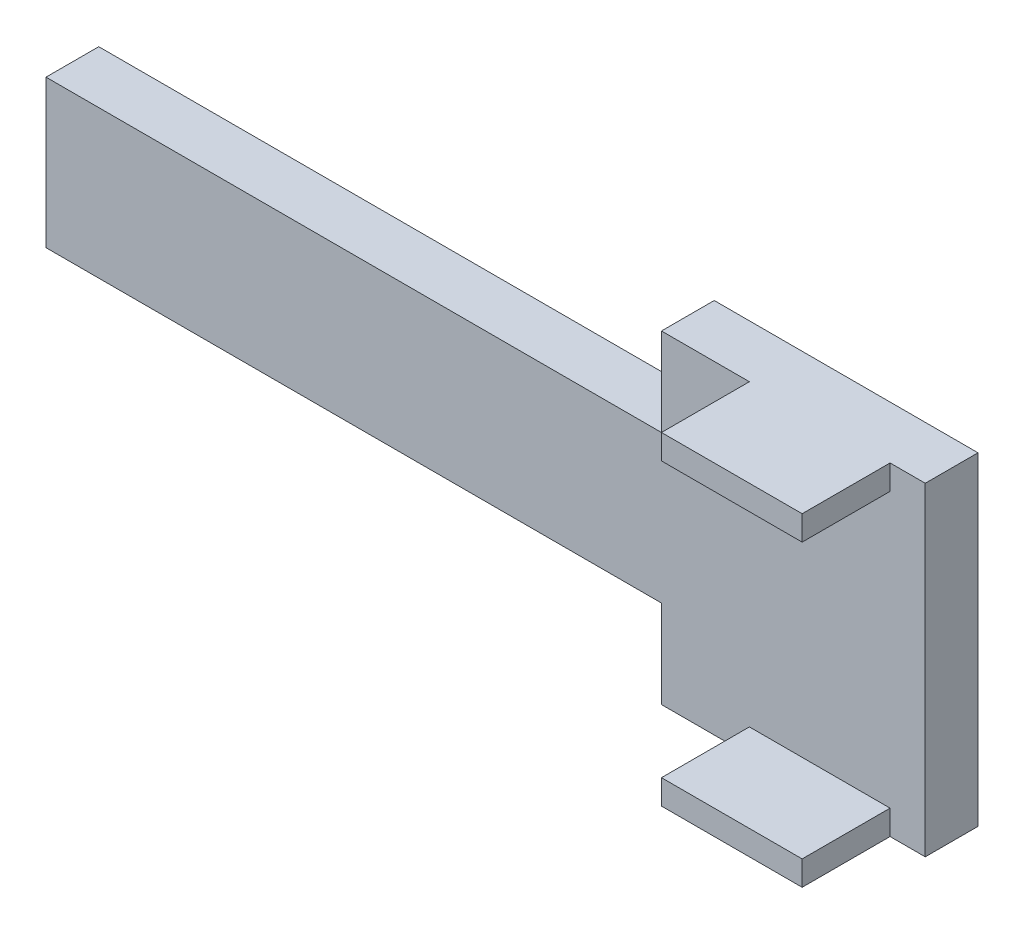
ISO-10303-21;
HEADER;
FILE_DESCRIPTION(('STEP AP214'),'2;1');
FILE_NAME('part.step','',(''),(''),'','','');
FILE_SCHEMA(('AUTOMOTIVE_DESIGN { 1 0 10303 214 1 1 1 1 }'));
ENDSEC;
DATA;
#1=APPLICATION_CONTEXT('core data for automotive mechanical design processes');
#2=APPLICATION_PROTOCOL_DEFINITION('international standard','automotive_design',2000,#1);
#3=PRODUCT_CONTEXT('',#1,'mechanical');
#4=PRODUCT('Part','Part','',(#3));
#5=PRODUCT_RELATED_PRODUCT_CATEGORY('part','',(#4));
#6=PRODUCT_DEFINITION_FORMATION('','',#4);
#7=PRODUCT_DEFINITION_CONTEXT('part definition',#1,'design');
#8=PRODUCT_DEFINITION('design','',#6,#7);
#9=PRODUCT_DEFINITION_SHAPE('','',#8);
#10=(LENGTH_UNIT() NAMED_UNIT(*) SI_UNIT(.MILLI.,.METRE.));
#11=(NAMED_UNIT(*) PLANE_ANGLE_UNIT() SI_UNIT($,.RADIAN.));
#12=(NAMED_UNIT(*) SI_UNIT($,.STERADIAN.) SOLID_ANGLE_UNIT());
#13=UNCERTAINTY_MEASURE_WITH_UNIT(LENGTH_MEASURE(1.E-05),#10,'distance_accuracy_value','');
#14=(GEOMETRIC_REPRESENTATION_CONTEXT(3) GLOBAL_UNCERTAINTY_ASSIGNED_CONTEXT((#13)) GLOBAL_UNIT_ASSIGNED_CONTEXT((#10,
#11,#12)) REPRESENTATION_CONTEXT('',''));
#15=CARTESIAN_POINT('',(0.,0.,0.));
#16=DIRECTION('',(0.,0.,1.));
#17=DIRECTION('',(1.,0.,0.));
#18=AXIS2_PLACEMENT_3D('',#15,#16,#17);
#19=CARTESIAN_POINT('',(-0.139449066959385,0.,3.84185455543359));
#20=DIRECTION('',(0.,0.,-1.));
#21=DIRECTION('',(-1.,0.,0.));
#22=AXIS2_PLACEMENT_3D('',#19,#20,#21);
#23=PLANE('',#22);
#24=DIRECTION('',(0.,-1.,0.));
#25=VECTOR('',#24,1.);
#26=CARTESIAN_POINT('',(12.8145509330406,11.91768,3.84185455543359));
#27=LINE('',#26,#25);
#28=CARTESIAN_POINT('',(12.8145509330406,11.91768,3.84185455543359));
#29=VERTEX_POINT('',#28);
#30=CARTESIAN_POINT('',(12.8145509330406,5.44068,3.84185455543359));
#31=VERTEX_POINT('',#30);
#32=EDGE_CURVE('E157',#29,#31,#27,.T.);
#33=ORIENTED_EDGE('',*,*,#32,.T.);
#34=DIRECTION('',(-1.,0.,0.));
#35=VECTOR('',#34,1.);
#36=CARTESIAN_POINT('',(-32.5244490669594,5.44068,3.84185455543359));
#37=LINE('',#36,#35);
#38=CARTESIAN_POINT('',(-32.5244490669594,5.44068,3.84185455543359));
#39=VERTEX_POINT('',#38);
#40=EDGE_CURVE('E302',#31,#39,#37,.T.);
#41=ORIENTED_EDGE('',*,*,#40,.T.);
#42=DIRECTION('',(0.,-1.,0.));
#43=VECTOR('',#42,1.);
#44=CARTESIAN_POINT('',(-32.5244490669594,-11.91768,3.84185455543359));
#45=LINE('',#44,#43);
#46=CARTESIAN_POINT('',(-32.5244490669594,-5.44068,3.84185455543359));
#47=VERTEX_POINT('',#46);
#48=EDGE_CURVE('E164',#39,#47,#45,.T.);
#49=ORIENTED_EDGE('',*,*,#48,.T.);
#50=DIRECTION('',(-1.,0.,0.));
#51=VECTOR('',#50,1.);
#52=CARTESIAN_POINT('',(-32.5244490669594,-5.44068,3.84185455543359));
#53=LINE('',#52,#51);
#54=CARTESIAN_POINT('',(12.8145509330406,-5.44068,3.84185455543359));
#55=VERTEX_POINT('',#54);
#56=EDGE_CURVE('E220',#55,#47,#53,.T.);
#57=ORIENTED_EDGE('',*,*,#56,.F.);
#58=DIRECTION('',(0.,1.,0.));
#59=VECTOR('',#58,1.);
#60=CARTESIAN_POINT('',(12.8145509330406,-11.91768,3.84185455543359));
#61=LINE('',#60,#59);
#62=CARTESIAN_POINT('',(12.8145509330406,-11.91768,3.84185455543359));
#63=VERTEX_POINT('',#62);
#64=EDGE_CURVE('E217',#63,#55,#61,.T.);
#65=ORIENTED_EDGE('',*,*,#64,.F.);
#66=DIRECTION('',(1.,0.,0.));
#67=VECTOR('',#66,1.);
#68=CARTESIAN_POINT('',(-32.5244490669594,-11.91768,3.84185455543359));
#69=LINE('',#68,#67);
#70=CARTESIAN_POINT('',(19.2915509330406,-11.91768,3.84185455543359));
#71=VERTEX_POINT('',#70);
#72=EDGE_CURVE('E178',#63,#71,#69,.T.);
#73=ORIENTED_EDGE('',*,*,#72,.T.);
#74=DIRECTION('',(0.,-1.,0.));
#75=VECTOR('',#74,1.);
#76=CARTESIAN_POINT('',(19.2915509330406,-11.91768,3.84185455543359));
#77=LINE('',#76,#75);
#78=CARTESIAN_POINT('',(19.2915509330406,-10.10412,3.84185455543359));
#79=VERTEX_POINT('',#78);
#80=EDGE_CURVE('E265',#79,#71,#77,.T.);
#81=ORIENTED_EDGE('',*,*,#80,.F.);
#82=DIRECTION('',(-1.,0.,0.));
#83=VECTOR('',#82,1.);
#84=CARTESIAN_POINT('',(32.2455509330406,-10.10412,3.84185455543359));
#85=LINE('',#84,#83);
#86=CARTESIAN_POINT('',(29.6547509330406,-10.10412,3.84185455543359));
#87=VERTEX_POINT('',#86);
#88=EDGE_CURVE('E261',#87,#79,#85,.T.);
#89=ORIENTED_EDGE('',*,*,#88,.F.);
#90=DIRECTION('',(0.,1.,0.));
#91=VECTOR('',#90,1.);
#92=CARTESIAN_POINT('',(29.6547509330406,-11.91768,3.84185455543359));
#93=LINE('',#92,#91);
#94=CARTESIAN_POINT('',(29.6547509330406,-11.91768,3.84185455543359));
#95=VERTEX_POINT('',#94);
#96=EDGE_CURVE('E254',#95,#87,#93,.T.);
#97=ORIENTED_EDGE('',*,*,#96,.F.);
#98=DIRECTION('',(-1.,0.,0.));
#99=VECTOR('',#98,1.);
#100=CARTESIAN_POINT('',(32.2455509330406,-11.91768,3.84185455543359));
#101=LINE('',#100,#99);
#102=CARTESIAN_POINT('',(32.2455509330406,-11.91768,3.84185455543359));
#103=VERTEX_POINT('',#102);
#104=EDGE_CURVE('E238',#103,#95,#101,.T.);
#105=ORIENTED_EDGE('',*,*,#104,.F.);
#106=DIRECTION('',(0.,1.,0.));
#107=VECTOR('',#106,1.);
#108=CARTESIAN_POINT('',(32.2455509330406,-11.91768,3.84185455543359));
#109=LINE('',#108,#107);
#110=CARTESIAN_POINT('',(32.2455509330406,11.91768,3.84185455543359));
#111=VERTEX_POINT('',#110);
#112=EDGE_CURVE('E171',#103,#111,#109,.T.);
#113=ORIENTED_EDGE('',*,*,#112,.T.);
#114=DIRECTION('',(-1.,0.,0.));
#115=VECTOR('',#114,1.);
#116=CARTESIAN_POINT('',(32.2455509330406,11.91768,3.84185455543359));
#117=LINE('',#116,#115);
#118=CARTESIAN_POINT('',(29.6547509330406,11.91768,3.84185455543359));
#119=VERTEX_POINT('',#118);
#120=EDGE_CURVE('E234',#111,#119,#117,.T.);
#121=ORIENTED_EDGE('',*,*,#120,.T.);
#122=CARTESIAN_POINT('',(29.6547509330406,10.10412,3.84185455543359));
#123=VERTEX_POINT('',#122);
#124=EDGE_CURVE('E245',#123,#119,#93,.T.);
#125=ORIENTED_EDGE('',*,*,#124,.F.);
#126=DIRECTION('',(1.,0.,0.));
#127=VECTOR('',#126,1.);
#128=CARTESIAN_POINT('',(32.2455509330406,10.10412,3.84185455543359));
#129=LINE('',#128,#127);
#130=CARTESIAN_POINT('',(19.2915509330406,10.10412,3.84185455543359));
#131=VERTEX_POINT('',#130);
#132=EDGE_CURVE('E281',#131,#123,#129,.T.);
#133=ORIENTED_EDGE('',*,*,#132,.F.);
#134=DIRECTION('',(0.,-1.,0.));
#135=VECTOR('',#134,1.);
#136=CARTESIAN_POINT('',(19.2915509330406,11.91768,3.84185455543359));
#137=LINE('',#136,#135);
#138=CARTESIAN_POINT('',(19.2915509330406,11.91768,3.84185455543359));
#139=VERTEX_POINT('',#138);
#140=EDGE_CURVE('E209',#139,#131,#137,.T.);
#141=ORIENTED_EDGE('',*,*,#140,.F.);
#142=DIRECTION('',(-1.,0.,0.));
#143=VECTOR('',#142,1.);
#144=CARTESIAN_POINT('',(-32.5244490669594,11.91768,3.84185455543359));
#145=LINE('',#144,#143);
#146=EDGE_CURVE('E189',#139,#29,#145,.T.);
#147=ORIENTED_EDGE('',*,*,#146,.T.);
#148=EDGE_LOOP('',(#33,#41,#49,#57,#65,#73,#81,#89,#97,#105,#113,#121,#125,#133,#141,#147));
#149=FACE_BOUND('',#148,.T.);
#150=ADVANCED_FACE('F37',(#149),#23,.F.);
#151=CARTESIAN_POINT('',(-32.5244490669594,11.91768,3.84185455543359));
#152=DIRECTION('',(0.,-1.,0.));
#153=DIRECTION('',(0.,0.,-1.));
#154=AXIS2_PLACEMENT_3D('',#151,#152,#153);
#155=PLANE('',#154);
#156=DIRECTION('',(0.,0.,1.));
#157=VECTOR('',#156,1.);
#158=CARTESIAN_POINT('',(12.8145509330406,11.91768,-0.0443454445664106));
#159=LINE('',#158,#157);
#160=CARTESIAN_POINT('',(12.8145509330406,11.91768,-0.0443454445664106));
#161=VERTEX_POINT('',#160);
#162=EDGE_CURVE('E214',#161,#29,#159,.T.);
#163=ORIENTED_EDGE('',*,*,#162,.T.);
#164=ORIENTED_EDGE('',*,*,#146,.F.);
#165=DIRECTION('',(0.,0.,-1.));
#166=VECTOR('',#165,1.);
#167=CARTESIAN_POINT('',(19.2915509330406,11.91768,10.3188545554336));
#168=LINE('',#167,#166);
#169=CARTESIAN_POINT('',(19.2915509330406,11.91768,10.3188545554336));
#170=VERTEX_POINT('',#169);
#171=EDGE_CURVE('E192',#170,#139,#168,.T.);
#172=ORIENTED_EDGE('',*,*,#171,.F.);
#173=DIRECTION('',(-1.,0.,0.));
#174=VECTOR('',#173,1.);
#175=CARTESIAN_POINT('',(32.2455509330406,11.91768,10.3188545554336));
#176=LINE('',#175,#174);
#177=CARTESIAN_POINT('',(29.6547509330406,11.91768,10.3188545554336));
#178=VERTEX_POINT('',#177);
#179=EDGE_CURVE('E278',#178,#170,#176,.T.);
#180=ORIENTED_EDGE('',*,*,#179,.F.);
#181=DIRECTION('',(0.,0.,1.));
#182=VECTOR('',#181,1.);
#183=CARTESIAN_POINT('',(29.6547509330406,11.91768,10.3188545554336));
#184=LINE('',#183,#182);
#185=EDGE_CURVE('E242',#119,#178,#184,.T.);
#186=ORIENTED_EDGE('',*,*,#185,.F.);
#187=ORIENTED_EDGE('',*,*,#120,.F.);
#188=DIRECTION('',(0.,0.,-1.));
#189=VECTOR('',#188,1.);
#190=CARTESIAN_POINT('',(32.2455509330406,11.91768,3.84185455543359));
#191=LINE('',#190,#189);
#192=CARTESIAN_POINT('',(32.2455509330406,11.91768,-0.0443454445664106));
#193=VERTEX_POINT('',#192);
#194=EDGE_CURVE('E11',#111,#193,#191,.T.);
#195=ORIENTED_EDGE('',*,*,#194,.T.);
#196=DIRECTION('',(-1.,0.,0.));
#197=VECTOR('',#196,1.);
#198=CARTESIAN_POINT('',(-32.5244490669594,11.91768,-0.0443454445664106));
#199=LINE('',#198,#197);
#200=EDGE_CURVE('E169',#193,#161,#199,.T.);
#201=ORIENTED_EDGE('',*,*,#200,.T.);
#202=EDGE_LOOP('',(#163,#164,#172,#180,#186,#187,#195,#201));
#203=FACE_BOUND('',#202,.T.);
#204=ADVANCED_FACE('F212',(#203),#155,.F.);
#205=CARTESIAN_POINT('',(-32.5244490669594,-11.91768,3.84185455543359));
#206=DIRECTION('',(1.,0.,0.));
#207=DIRECTION('',(0.,0.,-1.));
#208=AXIS2_PLACEMENT_3D('',#205,#206,#207);
#209=PLANE('',#208);
#210=DIRECTION('',(0.,0.,1.));
#211=VECTOR('',#210,1.);
#212=CARTESIAN_POINT('',(-32.5244490669594,5.44068,-0.0443454445664106));
#213=LINE('',#212,#211);
#214=CARTESIAN_POINT('',(-32.5244490669594,5.44068,-0.0443454445664106));
#215=VERTEX_POINT('',#214);
#216=EDGE_CURVE('E151',#215,#39,#213,.T.);
#217=ORIENTED_EDGE('',*,*,#216,.F.);
#218=DIRECTION('',(0.,-1.,0.));
#219=VECTOR('',#218,1.);
#220=CARTESIAN_POINT('',(-32.5244490669594,-11.91768,-0.0443454445664106));
#221=LINE('',#220,#219);
#222=CARTESIAN_POINT('',(-32.5244490669594,-5.44068,-0.0443454445664106));
#223=VERTEX_POINT('',#222);
#224=EDGE_CURVE('E163',#215,#223,#221,.T.);
#225=ORIENTED_EDGE('',*,*,#224,.T.);
#226=DIRECTION('',(0.,0.,1.));
#227=VECTOR('',#226,1.);
#228=CARTESIAN_POINT('',(-32.5244490669594,-5.44068,-0.0443454445664106));
#229=LINE('',#228,#227);
#230=EDGE_CURVE('E232',#223,#47,#229,.T.);
#231=ORIENTED_EDGE('',*,*,#230,.T.);
#232=ORIENTED_EDGE('',*,*,#48,.F.);
#233=EDGE_LOOP('',(#217,#225,#231,#232));
#234=FACE_BOUND('',#233,.T.);
#235=ADVANCED_FACE('F161',(#234),#209,.F.);
#236=CARTESIAN_POINT('',(-0.139449066959385,0.,-0.0443454445664106));
#237=DIRECTION('',(0.,0.,-1.));
#238=DIRECTION('',(-1.,0.,0.));
#239=AXIS2_PLACEMENT_3D('',#236,#237,#238);
#240=PLANE('',#239);
#241=DIRECTION('',(-1.,0.,0.));
#242=VECTOR('',#241,1.);
#243=CARTESIAN_POINT('',(-32.5244490669594,5.44068,-0.0443454445664106));
#244=LINE('',#243,#242);
#245=CARTESIAN_POINT('',(12.8145509330406,5.44068,-0.0443454445664106));
#246=VERTEX_POINT('',#245);
#247=EDGE_CURVE('E148',#246,#215,#244,.T.);
#248=ORIENTED_EDGE('',*,*,#247,.F.);
#249=DIRECTION('',(0.,-1.,0.));
#250=VECTOR('',#249,1.);
#251=CARTESIAN_POINT('',(12.8145509330406,11.91768,-0.0443454445664106));
#252=LINE('',#251,#250);
#253=EDGE_CURVE('E156',#161,#246,#252,.T.);
#254=ORIENTED_EDGE('',*,*,#253,.F.);
#255=ORIENTED_EDGE('',*,*,#200,.F.);
#256=DIRECTION('',(0.,1.,0.));
#257=VECTOR('',#256,1.);
#258=CARTESIAN_POINT('',(32.2455509330406,-11.91768,-0.0443454445664106));
#259=LINE('',#258,#257);
#260=CARTESIAN_POINT('',(32.2455509330406,-11.91768,-0.0443454445664106));
#261=VERTEX_POINT('',#260);
#262=EDGE_CURVE('E174',#261,#193,#259,.T.);
#263=ORIENTED_EDGE('',*,*,#262,.F.);
#264=DIRECTION('',(1.,0.,0.));
#265=VECTOR('',#264,1.);
#266=CARTESIAN_POINT('',(-32.5244490669594,-11.91768,-0.0443454445664106));
#267=LINE('',#266,#265);
#268=CARTESIAN_POINT('',(12.8145509330406,-11.91768,-0.0443454445664106));
#269=VERTEX_POINT('',#268);
#270=EDGE_CURVE('E168',#269,#261,#267,.T.);
#271=ORIENTED_EDGE('',*,*,#270,.F.);
#272=DIRECTION('',(0.,1.,0.));
#273=VECTOR('',#272,1.);
#274=CARTESIAN_POINT('',(12.8145509330406,-11.91768,-0.0443454445664106));
#275=LINE('',#274,#273);
#276=CARTESIAN_POINT('',(12.8145509330406,-5.44068,-0.0443454445664106));
#277=VERTEX_POINT('',#276);
#278=EDGE_CURVE('E226',#269,#277,#275,.T.);
#279=ORIENTED_EDGE('',*,*,#278,.T.);
#280=DIRECTION('',(-1.,0.,0.));
#281=VECTOR('',#280,1.);
#282=CARTESIAN_POINT('',(-32.5244490669594,-5.44068,-0.0443454445664106));
#283=LINE('',#282,#281);
#284=EDGE_CURVE('E60',#277,#223,#283,.T.);
#285=ORIENTED_EDGE('',*,*,#284,.T.);
#286=ORIENTED_EDGE('',*,*,#224,.F.);
#287=EDGE_LOOP('',(#248,#254,#255,#263,#271,#279,#285,#286));
#288=FACE_BOUND('',#287,.T.);
#289=ADVANCED_FACE('F166',(#288),#240,.T.);
#290=CARTESIAN_POINT('',(32.2455509330406,-11.91768,3.84185455543359));
#291=DIRECTION('',(-1.,0.,0.));
#292=DIRECTION('',(0.,0.,1.));
#293=AXIS2_PLACEMENT_3D('',#290,#291,#292);
#294=PLANE('',#293);
#295=ORIENTED_EDGE('',*,*,#194,.F.);
#296=ORIENTED_EDGE('',*,*,#112,.F.);
#297=DIRECTION('',(0.,0.,-1.));
#298=VECTOR('',#297,1.);
#299=CARTESIAN_POINT('',(32.2455509330406,-11.91768,3.84185455543359));
#300=LINE('',#299,#298);
#301=EDGE_CURVE('E45',#103,#261,#300,.T.);
#302=ORIENTED_EDGE('',*,*,#301,.T.);
#303=ORIENTED_EDGE('',*,*,#262,.T.);
#304=EDGE_LOOP('',(#295,#296,#302,#303));
#305=FACE_BOUND('',#304,.T.);
#306=ADVANCED_FACE('F39',(#305),#294,.F.);
#307=CARTESIAN_POINT('',(-32.5244490669594,-11.91768,3.84185455543359));
#308=DIRECTION('',(0.,1.,0.));
#309=DIRECTION('',(0.,0.,1.));
#310=AXIS2_PLACEMENT_3D('',#307,#308,#309);
#311=PLANE('',#310);
#312=ORIENTED_EDGE('',*,*,#72,.F.);
#313=DIRECTION('',(0.,0.,1.));
#314=VECTOR('',#313,1.);
#315=CARTESIAN_POINT('',(12.8145509330406,-11.91768,-0.0443454445664106));
#316=LINE('',#315,#314);
#317=EDGE_CURVE('E228',#269,#63,#316,.T.);
#318=ORIENTED_EDGE('',*,*,#317,.F.);
#319=ORIENTED_EDGE('',*,*,#270,.T.);
#320=ORIENTED_EDGE('',*,*,#301,.F.);
#321=ORIENTED_EDGE('',*,*,#104,.T.);
#322=DIRECTION('',(0.,0.,1.));
#323=VECTOR('',#322,1.);
#324=CARTESIAN_POINT('',(29.6547509330406,-11.91768,10.3188545554336));
#325=LINE('',#324,#323);
#326=CARTESIAN_POINT('',(29.6547509330406,-11.91768,10.3188545554336));
#327=VERTEX_POINT('',#326);
#328=EDGE_CURVE('E241',#95,#327,#325,.T.);
#329=ORIENTED_EDGE('',*,*,#328,.T.);
#330=DIRECTION('',(1.,0.,0.));
#331=VECTOR('',#330,1.);
#332=CARTESIAN_POINT('',(32.2455509330406,-11.91768,10.3188545554336));
#333=LINE('',#332,#331);
#334=CARTESIAN_POINT('',(19.2915509330406,-11.91768,10.3188545554336));
#335=VERTEX_POINT('',#334);
#336=EDGE_CURVE('E267',#335,#327,#333,.T.);
#337=ORIENTED_EDGE('',*,*,#336,.F.);
#338=DIRECTION('',(0.,0.,-1.));
#339=VECTOR('',#338,1.);
#340=CARTESIAN_POINT('',(19.2915509330406,-11.91768,10.3188545554336));
#341=LINE('',#340,#339);
#342=EDGE_CURVE('E270',#335,#71,#341,.T.);
#343=ORIENTED_EDGE('',*,*,#342,.T.);
#344=EDGE_LOOP('',(#312,#318,#319,#320,#321,#329,#337,#343));
#345=FACE_BOUND('',#344,.T.);
#346=ADVANCED_FACE('F309',(#345),#311,.F.);
#347=CARTESIAN_POINT('',(19.2915509330406,11.91768,10.3188545554336));
#348=DIRECTION('',(1.,0.,0.));
#349=DIRECTION('',(0.,0.,-1.));
#350=AXIS2_PLACEMENT_3D('',#347,#348,#349);
#351=PLANE('',#350);
#352=ORIENTED_EDGE('',*,*,#140,.T.);
#353=DIRECTION('',(0.,0.,-1.));
#354=VECTOR('',#353,1.);
#355=CARTESIAN_POINT('',(19.2915509330406,10.10412,10.3188545554336));
#356=LINE('',#355,#354);
#357=CARTESIAN_POINT('',(19.2915509330406,10.10412,10.3188545554336));
#358=VERTEX_POINT('',#357);
#359=EDGE_CURVE('E195',#358,#131,#356,.T.);
#360=ORIENTED_EDGE('',*,*,#359,.F.);
#361=DIRECTION('',(0.,-1.,0.));
#362=VECTOR('',#361,1.);
#363=CARTESIAN_POINT('',(19.2915509330406,11.91768,10.3188545554336));
#364=LINE('',#363,#362);
#365=EDGE_CURVE('E280',#170,#358,#364,.T.);
#366=ORIENTED_EDGE('',*,*,#365,.F.);
#367=ORIENTED_EDGE('',*,*,#171,.T.);
#368=EDGE_LOOP('',(#352,#360,#366,#367));
#369=FACE_BOUND('',#368,.T.);
#370=ADVANCED_FACE('F291',(#369),#351,.F.);
#371=CARTESIAN_POINT('',(32.2455509330406,10.10412,10.3188545554336));
#372=DIRECTION('',(0.,1.,0.));
#373=DIRECTION('',(0.,0.,1.));
#374=AXIS2_PLACEMENT_3D('',#371,#372,#373);
#375=PLANE('',#374);
#376=ORIENTED_EDGE('',*,*,#132,.T.);
#377=DIRECTION('',(0.,0.,1.));
#378=VECTOR('',#377,1.);
#379=CARTESIAN_POINT('',(29.6547509330406,10.10412,10.3188545554336));
#380=LINE('',#379,#378);
#381=CARTESIAN_POINT('',(29.6547509330406,10.10412,10.3188545554336));
#382=VERTEX_POINT('',#381);
#383=EDGE_CURVE('E258',#123,#382,#380,.T.);
#384=ORIENTED_EDGE('',*,*,#383,.T.);
#385=DIRECTION('',(1.,0.,0.));
#386=VECTOR('',#385,1.);
#387=CARTESIAN_POINT('',(32.2455509330406,10.10412,10.3188545554336));
#388=LINE('',#387,#386);
#389=EDGE_CURVE('E202',#358,#382,#388,.T.);
#390=ORIENTED_EDGE('',*,*,#389,.F.);
#391=ORIENTED_EDGE('',*,*,#359,.T.);
#392=EDGE_LOOP('',(#376,#384,#390,#391));
#393=FACE_BOUND('',#392,.T.);
#394=ADVANCED_FACE('F287',(#393),#375,.F.);
#395=CARTESIAN_POINT('',(-0.139449066959385,0.,10.3188545554336));
#396=DIRECTION('',(0.,0.,-1.));
#397=DIRECTION('',(-1.,0.,0.));
#398=AXIS2_PLACEMENT_3D('',#395,#396,#397);
#399=PLANE('',#398);
#400=ORIENTED_EDGE('',*,*,#389,.T.);
#401=DIRECTION('',(0.,1.,0.));
#402=VECTOR('',#401,1.);
#403=CARTESIAN_POINT('',(29.6547509330406,-11.91768,10.3188545554336));
#404=LINE('',#403,#402);
#405=EDGE_CURVE('E253',#382,#178,#404,.T.);
#406=ORIENTED_EDGE('',*,*,#405,.T.);
#407=ORIENTED_EDGE('',*,*,#179,.T.);
#408=ORIENTED_EDGE('',*,*,#365,.T.);
#409=EDGE_LOOP('',(#400,#406,#407,#408));
#410=FACE_BOUND('',#409,.T.);
#411=ADVANCED_FACE('F294',(#410),#399,.F.);
#412=CARTESIAN_POINT('',(32.2455509330406,-10.10412,10.3188545554336));
#413=DIRECTION('',(0.,-1.,0.));
#414=DIRECTION('',(1.,0.,0.));
#415=AXIS2_PLACEMENT_3D('',#412,#413,#414);
#416=PLANE('',#415);
#417=DIRECTION('',(-1.,0.,0.));
#418=VECTOR('',#417,1.);
#419=CARTESIAN_POINT('',(32.2455509330406,-10.10412,10.3188545554336));
#420=LINE('',#419,#418);
#421=CARTESIAN_POINT('',(29.6547509330406,-10.10412,10.3188545554336));
#422=VERTEX_POINT('',#421);
#423=CARTESIAN_POINT('',(19.2915509330406,-10.10412,10.3188545554336));
#424=VERTEX_POINT('',#423);
#425=EDGE_CURVE('E262',#422,#424,#420,.T.);
#426=ORIENTED_EDGE('',*,*,#425,.F.);
#427=DIRECTION('',(0.,0.,-1.));
#428=VECTOR('',#427,1.);
#429=CARTESIAN_POINT('',(29.6547509330406,-10.10412,10.3188545554336));
#430=LINE('',#429,#428);
#431=EDGE_CURVE('E252',#422,#87,#430,.T.);
#432=ORIENTED_EDGE('',*,*,#431,.T.);
#433=ORIENTED_EDGE('',*,*,#88,.T.);
#434=DIRECTION('',(0.,0.,-1.));
#435=VECTOR('',#434,1.);
#436=CARTESIAN_POINT('',(19.2915509330406,-10.10412,10.3188545554336));
#437=LINE('',#436,#435);
#438=EDGE_CURVE('E275',#424,#79,#437,.T.);
#439=ORIENTED_EDGE('',*,*,#438,.F.);
#440=EDGE_LOOP('',(#426,#432,#433,#439));
#441=FACE_BOUND('',#440,.T.);
#442=ADVANCED_FACE('F320',(#441),#416,.F.);
#443=CARTESIAN_POINT('',(19.2915509330406,-11.91768,10.3188545554336));
#444=DIRECTION('',(1.,0.,0.));
#445=DIRECTION('',(0.,0.,-1.));
#446=AXIS2_PLACEMENT_3D('',#443,#444,#445);
#447=PLANE('',#446);
#448=ORIENTED_EDGE('',*,*,#80,.T.);
#449=ORIENTED_EDGE('',*,*,#342,.F.);
#450=DIRECTION('',(0.,-1.,0.));
#451=VECTOR('',#450,1.);
#452=CARTESIAN_POINT('',(19.2915509330406,-11.91768,10.3188545554336));
#453=LINE('',#452,#451);
#454=EDGE_CURVE('E264',#424,#335,#453,.T.);
#455=ORIENTED_EDGE('',*,*,#454,.F.);
#456=ORIENTED_EDGE('',*,*,#438,.T.);
#457=EDGE_LOOP('',(#448,#449,#455,#456));
#458=FACE_BOUND('',#457,.T.);
#459=ADVANCED_FACE('F314',(#458),#447,.F.);
#460=CARTESIAN_POINT('',(-0.139449066959385,0.,10.3188545554336));
#461=DIRECTION('',(0.,0.,1.));
#462=DIRECTION('',(1.,0.,0.));
#463=AXIS2_PLACEMENT_3D('',#460,#461,#462);
#464=PLANE('',#463);
#465=EDGE_CURVE('E249',#327,#422,#404,.T.);
#466=ORIENTED_EDGE('',*,*,#465,.T.);
#467=ORIENTED_EDGE('',*,*,#425,.T.);
#468=ORIENTED_EDGE('',*,*,#454,.T.);
#469=ORIENTED_EDGE('',*,*,#336,.T.);
#470=EDGE_LOOP('',(#466,#467,#468,#469));
#471=FACE_BOUND('',#470,.T.);
#472=ADVANCED_FACE('F324',(#471),#464,.T.);
#473=CARTESIAN_POINT('',(29.6547509330406,-11.91768,10.3188545554336));
#474=DIRECTION('',(-1.,0.,0.));
#475=DIRECTION('',(0.,0.,1.));
#476=AXIS2_PLACEMENT_3D('',#473,#474,#475);
#477=PLANE('',#476);
#478=ORIENTED_EDGE('',*,*,#465,.F.);
#479=ORIENTED_EDGE('',*,*,#328,.F.);
#480=ORIENTED_EDGE('',*,*,#96,.T.);
#481=ORIENTED_EDGE('',*,*,#431,.F.);
#482=EDGE_LOOP('',(#478,#479,#480,#481));
#483=FACE_BOUND('',#482,.T.);
#484=ADVANCED_FACE('F322',(#483),#477,.F.);
#485=ORIENTED_EDGE('',*,*,#124,.T.);
#486=ORIENTED_EDGE('',*,*,#185,.T.);
#487=ORIENTED_EDGE('',*,*,#405,.F.);
#488=ORIENTED_EDGE('',*,*,#383,.F.);
#489=EDGE_LOOP('',(#485,#486,#487,#488));
#490=FACE_BOUND('',#489,.T.);
#491=ADVANCED_FACE('F298',(#490),#477,.F.);
#492=CARTESIAN_POINT('',(-32.5244490669594,-5.44068,-0.0443454445664106));
#493=DIRECTION('',(0.,1.,0.));
#494=DIRECTION('',(0.,0.,1.));
#495=AXIS2_PLACEMENT_3D('',#492,#493,#494);
#496=PLANE('',#495);
#497=ORIENTED_EDGE('',*,*,#56,.T.);
#498=ORIENTED_EDGE('',*,*,#230,.F.);
#499=ORIENTED_EDGE('',*,*,#284,.F.);
#500=DIRECTION('',(0.,0.,1.));
#501=VECTOR('',#500,1.);
#502=CARTESIAN_POINT('',(12.8145509330406,-5.44068,-0.0443454445664106));
#503=LINE('',#502,#501);
#504=EDGE_CURVE('E235',#277,#55,#503,.T.);
#505=ORIENTED_EDGE('',*,*,#504,.T.);
#506=EDGE_LOOP('',(#497,#498,#499,#505));
#507=FACE_BOUND('',#506,.T.);
#508=ADVANCED_FACE('F304',(#507),#496,.F.);
#509=CARTESIAN_POINT('',(12.8145509330406,-11.91768,-0.0443454445664106));
#510=DIRECTION('',(1.,0.,0.));
#511=DIRECTION('',(0.,0.,-1.));
#512=AXIS2_PLACEMENT_3D('',#509,#510,#511);
#513=PLANE('',#512);
#514=ORIENTED_EDGE('',*,*,#64,.T.);
#515=ORIENTED_EDGE('',*,*,#504,.F.);
#516=ORIENTED_EDGE('',*,*,#278,.F.);
#517=ORIENTED_EDGE('',*,*,#317,.T.);
#518=EDGE_LOOP('',(#514,#515,#516,#517));
#519=FACE_BOUND('',#518,.T.);
#520=ADVANCED_FACE('F306',(#519),#513,.F.);
#521=CARTESIAN_POINT('',(12.8145509330406,11.91768,-0.0443454445664106));
#522=DIRECTION('',(-1.,0.,0.));
#523=DIRECTION('',(0.,0.,1.));
#524=AXIS2_PLACEMENT_3D('',#521,#522,#523);
#525=PLANE('',#524);
#526=ORIENTED_EDGE('',*,*,#32,.F.);
#527=ORIENTED_EDGE('',*,*,#162,.F.);
#528=ORIENTED_EDGE('',*,*,#253,.T.);
#529=DIRECTION('',(0.,0.,1.));
#530=VECTOR('',#529,1.);
#531=CARTESIAN_POINT('',(12.8145509330406,5.44068,-0.0443454445664106));
#532=LINE('',#531,#530);
#533=EDGE_CURVE('E52',#246,#31,#532,.T.);
#534=ORIENTED_EDGE('',*,*,#533,.T.);
#535=EDGE_LOOP('',(#526,#527,#528,#534));
#536=FACE_BOUND('',#535,.T.);
#537=ADVANCED_FACE('F423',(#536),#525,.T.);
#538=CARTESIAN_POINT('',(-32.5244490669594,5.44068,-0.0443454445664106));
#539=DIRECTION('',(0.,1.,0.));
#540=DIRECTION('',(0.,0.,1.));
#541=AXIS2_PLACEMENT_3D('',#538,#539,#540);
#542=PLANE('',#541);
#543=ORIENTED_EDGE('',*,*,#40,.F.);
#544=ORIENTED_EDGE('',*,*,#533,.F.);
#545=ORIENTED_EDGE('',*,*,#247,.T.);
#546=ORIENTED_EDGE('',*,*,#216,.T.);
#547=EDGE_LOOP('',(#543,#544,#545,#546));
#548=FACE_BOUND('',#547,.T.);
#549=ADVANCED_FACE('F150',(#548),#542,.T.);
#550=CLOSED_SHELL('',(#150,#204,#235,#289,#306,#346,#370,#394,#411,#442,#459,#472,#484,#491,
#508,#520,#537,#549));
#551=MANIFOLD_SOLID_BREP('B2',#550);
#552=ADVANCED_BREP_SHAPE_REPRESENTATION('',(#18,#551),#14);
#553=SHAPE_DEFINITION_REPRESENTATION(#9,#552);
ENDSEC;
END-ISO-10303-21;
